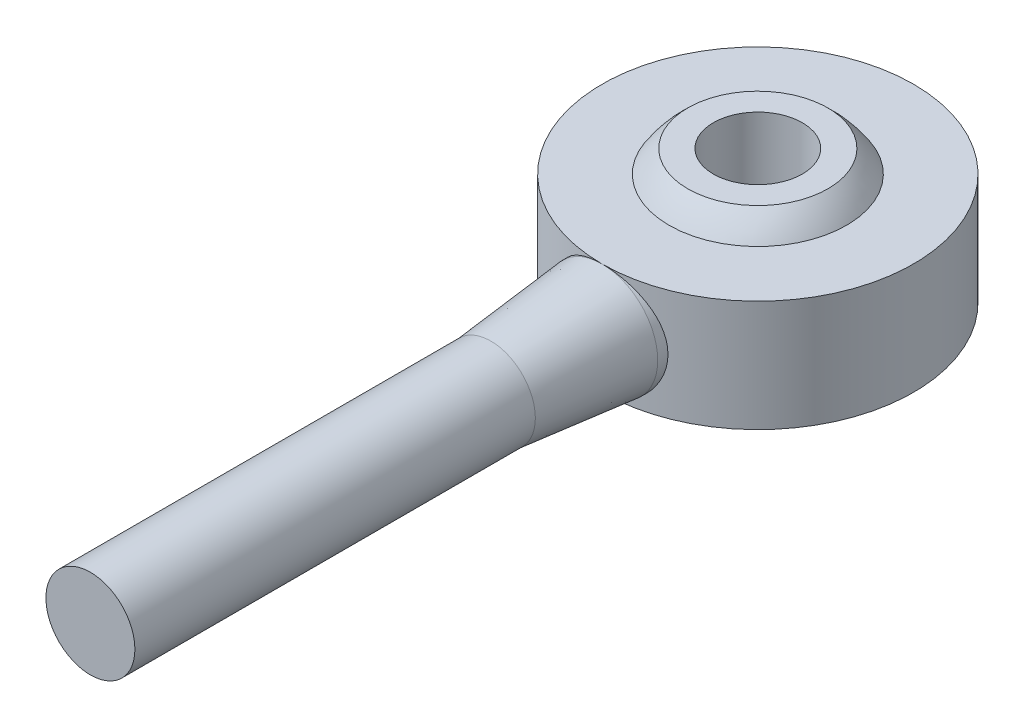
ISO-10303-21;
HEADER;
FILE_DESCRIPTION(('STEP AP214'),'2;1');
FILE_NAME('part.step','',(''),(''),'','','');
FILE_SCHEMA(('AUTOMOTIVE_DESIGN { 1 0 10303 214 1 1 1 1 }'));
ENDSEC;
DATA;
#1=APPLICATION_CONTEXT('core data for automotive mechanical design processes');
#2=APPLICATION_PROTOCOL_DEFINITION('international standard','automotive_design',2000,#1);
#3=PRODUCT_CONTEXT('',#1,'mechanical');
#4=PRODUCT('Part','Part','',(#3));
#5=PRODUCT_RELATED_PRODUCT_CATEGORY('part','',(#4));
#6=PRODUCT_DEFINITION_FORMATION('','',#4);
#7=PRODUCT_DEFINITION_CONTEXT('part definition',#1,'design');
#8=PRODUCT_DEFINITION('design','',#6,#7);
#9=PRODUCT_DEFINITION_SHAPE('','',#8);
#10=(LENGTH_UNIT() NAMED_UNIT(*) SI_UNIT(.MILLI.,.METRE.));
#11=(NAMED_UNIT(*) PLANE_ANGLE_UNIT() SI_UNIT($,.RADIAN.));
#12=(NAMED_UNIT(*) SI_UNIT($,.STERADIAN.) SOLID_ANGLE_UNIT());
#13=UNCERTAINTY_MEASURE_WITH_UNIT(LENGTH_MEASURE(1.E-05),#10,'distance_accuracy_value','');
#14=(GEOMETRIC_REPRESENTATION_CONTEXT(3) GLOBAL_UNCERTAINTY_ASSIGNED_CONTEXT((#13)) GLOBAL_UNIT_ASSIGNED_CONTEXT((#10,
#11,#12)) REPRESENTATION_CONTEXT('',''));
#15=CARTESIAN_POINT('',(0.,0.,0.));
#16=DIRECTION('',(0.,0.,1.));
#17=DIRECTION('',(1.,0.,0.));
#18=AXIS2_PLACEMENT_3D('',#15,#16,#17);
#19=CARTESIAN_POINT('',(0.,2.5,0.));
#20=DIRECTION('',(0.,-1.,0.));
#21=DIRECTION('',(0.,0.,-1.));
#22=AXIS2_PLACEMENT_3D('',#19,#20,#21);
#23=CYLINDRICAL_SURFACE('',#22,7.);
#24=CARTESIAN_POINT('',(0.,2.5,7.));
#25=CARTESIAN_POINT('',(-0.135839760518735,2.50000282404186,7.0000020295295));
#26=CARTESIAN_POINT('',(-0.271659429947531,2.48889324276718,6.99601056603649));
#27=CARTESIAN_POINT('',(-0.539264896606897,2.44490871280793,6.98048404948616));
#28=CARTESIAN_POINT('',(-0.671050847614628,2.41203459493519,6.96894928437749));
#29=CARTESIAN_POINT('',(-0.926692116674317,2.32581485873255,6.93958109810981));
#30=CARTESIAN_POINT('',(-1.05056137145919,2.27250644028005,6.92175912724346));
#31=CARTESIAN_POINT('',(-1.28759585298401,2.14711128063239,6.88161078032354));
#32=CARTESIAN_POINT('',(-1.40075850640075,2.07502004055099,6.85928332539979));
#33=CARTESIAN_POINT('',(-1.61758802805347,1.9111568678836,6.81147377429754));
#34=CARTESIAN_POINT('',(-1.72078015672851,1.81878126899463,6.78590827445072));
#35=CARTESIAN_POINT('',(-1.9105819932243,1.61825363621021,6.73493522536265));
#36=CARTESIAN_POINT('',(-1.99718728701346,1.51009741628361,6.70952771990193));
#37=CARTESIAN_POINT('',(-2.15423735561842,1.27660220722431,6.6608007016897));
#38=CARTESIAN_POINT('',(-2.2240352979483,1.15080525648352,6.63758107761794));
#39=CARTESIAN_POINT('',(-2.34127572230003,0.888296335295655,6.59714352451506));
#40=CARTESIAN_POINT('',(-2.38872619231546,0.751588285432287,6.57992345154766));
#41=CARTESIAN_POINT('',(-2.45809130448528,0.476577163797531,6.55432038222057));
#42=CARTESIAN_POINT('',(-2.48090519407331,0.33853069305689,6.54562733379002));
#43=CARTESIAN_POINT('',(-2.5031615222748,0.0603163681762025,6.53715061879805));
#44=CARTESIAN_POINT('',(-2.50261249605974,-0.0798506925415497,6.53736369856128));
#45=CARTESIAN_POINT('',(-2.4788507897233,-0.350355655052487,6.54640588297195));
#46=CARTESIAN_POINT('',(-2.45685161763648,-0.480818352999741,6.55477363669039));
#47=CARTESIAN_POINT('',(-2.3928085105506,-0.736061527183343,6.57842082174382));
#48=CARTESIAN_POINT('',(-2.35076183734614,-0.860841224650792,6.59370119723067));
#49=CARTESIAN_POINT('',(-2.247095668441,-1.10377374578572,6.62975170487814));
#50=CARTESIAN_POINT('',(-2.18514195933256,-1.22176960265853,6.65061447775042));
#51=CARTESIAN_POINT('',(-2.04365272690694,-1.44605638664971,6.69544469696369));
#52=CARTESIAN_POINT('',(-1.96411154980233,-1.55234353330741,6.71941314064672));
#53=CARTESIAN_POINT('',(-1.78403149047107,-1.75695959137113,6.76952498465894));
#54=CARTESIAN_POINT('',(-1.68251331515438,-1.85441785924916,6.7957122347435));
#55=CARTESIAN_POINT('',(-1.46426184534914,-2.03117168283478,6.84605473605515));
#56=CARTESIAN_POINT('',(-1.3475266301937,-2.11046494229876,6.87020973014028));
#57=CARTESIAN_POINT('',(-1.10010034292175,-2.2494806099392,6.91416998722002));
#58=CARTESIAN_POINT('',(-0.96924911242521,-2.30893823988978,6.93391532170414));
#59=CARTESIAN_POINT('',(-0.698523468127248,-2.40471582416036,6.96639167687355));
#60=CARTESIAN_POINT('',(-0.558652699053766,-2.44104506076263,6.97912551125634));
#61=CARTESIAN_POINT('',(-0.281205091813833,-2.48791915065958,6.99566202632136));
#62=CARTESIAN_POINT('',(-0.143850613169092,-2.49963813074565,6.99987103999093));
#63=CARTESIAN_POINT('',(0.130909371573394,-2.50034512199022,7.00012297890716));
#64=CARTESIAN_POINT('',(0.268314862212672,-2.48933762699178,6.99616751856457));
#65=CARTESIAN_POINT('',(0.53436869899777,-2.44581386267842,6.98080349995239));
#66=CARTESIAN_POINT('',(0.663155848081401,-2.41404524420185,6.96965417819419));
#67=CARTESIAN_POINT('',(0.913499444029995,-2.33086340526394,6.94128245796678));
#68=CARTESIAN_POINT('',(1.03505494970017,-2.27944763417143,6.9240592709991));
#69=CARTESIAN_POINT('',(1.27131790851501,-2.15684114659839,6.88465739573328));
#70=CARTESIAN_POINT('',(1.38573546298722,-2.08513351950063,6.86235262462323));
#71=CARTESIAN_POINT('',(1.60127936897371,-1.92457250489255,6.81528395513799));
#72=CARTESIAN_POINT('',(1.70240114063959,-1.83571323522616,6.79051921453452));
#73=CARTESIAN_POINT('',(1.89402292059753,-1.63787036727108,6.73966040960453));
#74=CARTESIAN_POINT('',(1.98368681906969,-1.52807528698033,6.71356479866296));
#75=CARTESIAN_POINT('',(2.14345525781599,-1.29445872999565,6.6642787599771));
#76=CARTESIAN_POINT('',(2.21355884309556,-1.17063656887139,6.64108847411013));
#77=CARTESIAN_POINT('',(2.33208686094212,-0.911935190763942,6.60040332956606));
#78=CARTESIAN_POINT('',(2.3804881075604,-0.777044329490132,6.58291456759544));
#79=CARTESIAN_POINT('',(2.45361419016748,-0.500239899279892,6.55601442004241));
#80=CARTESIAN_POINT('',(2.4783518546378,-0.358330179337675,6.54659865821928));
#81=CARTESIAN_POINT('',(2.50236255506862,-0.0804795206269917,6.53745596427834));
#82=CARTESIAN_POINT('',(2.50304426978182,0.0553232144244185,6.53719306756498));
#83=CARTESIAN_POINT('',(2.48247035008869,0.324997670654891,6.54503319463772));
#84=CARTESIAN_POINT('',(2.46121642244208,0.458869541248156,6.55313556754228));
#85=CARTESIAN_POINT('',(2.39843007607193,0.717500585371859,6.57636700427785));
#86=CARTESIAN_POINT('',(2.35741961008936,0.842404099005789,6.59131474248996));
#87=CARTESIAN_POINT('',(2.25672644338171,1.08364268186691,6.62646329315119));
#88=CARTESIAN_POINT('',(2.19703924956895,1.1999756809442,6.64666536944648));
#89=CARTESIAN_POINT('',(2.05730313071904,1.42692574995226,6.69127230994833));
#90=CARTESIAN_POINT('',(1.97640371595173,1.53698804086291,6.71583400336863));
#91=CARTESIAN_POINT('',(1.79790863011924,1.74242750466051,6.76580411328317));
#92=CARTESIAN_POINT('',(1.70030791033581,1.83780022035101,6.79121278393859));
#93=CARTESIAN_POINT('',(1.48566252339524,2.01572190281657,6.84145445667706));
#94=CARTESIAN_POINT('',(1.36791750616705,2.09745303979088,6.86620367070764));
#95=CARTESIAN_POINT('',(1.11951131249464,2.23990766383788,6.91104924401846));
#96=CARTESIAN_POINT('',(0.988851114158936,2.3006327402027,6.93114595526313));
#97=CARTESIAN_POINT('',(0.717646336524983,2.39914031030858,6.96446006180832));
#98=CARTESIAN_POINT('',(0.577062560467784,2.43682540816267,6.97764821973896));
#99=CARTESIAN_POINT('',(0.290976881134821,2.48724887463881,6.99541542277591));
#100=CARTESIAN_POINT('',(0.145476919097826,2.49999697560635,6.99999782648543));
#101=CARTESIAN_POINT('',(0.,2.5,7.));
#102=B_SPLINE_CURVE_WITH_KNOTS('',3,(#24,#25,#26,#27,#28,#29,#30,#31,#32,#33,#34,#35,#36,#37,
#38,#39,#40,#41,#42,#43,#44,#45,#46,#47,#48,#49,#50,#51,#52,#53,#54,#55,#56,#57,#58,#59,#60,#61,
#62,#63,#64,#65,#66,#67,#68,#69,#70,#71,#72,#73,#74,#75,#76,#77,#78,#79,#80,#81,#82,#83,#84,#85,
#86,#87,#88,#89,#90,#91,#92,#93,#94,#95,#96,#97,#98,#99,#100,#101),.UNSPECIFIED.,.T.,.F.,(4,2,2,
2,2,2,2,2,2,2,2,2,2,2,2,2,2,2,2,2,2,2,2,2,2,2,2,2,2,2,2,2,2,2,2,2,2,2,4),(0.,0.406983217142954,
0.813950899519932,1.22018120425629,1.62650889940498,2.04714572459521,2.46789433314937,
2.90289606780334,3.3377421950035,3.75611562378725,4.17433620956451,4.57019246497947,
4.96610280426156,5.36904149669469,5.77210990935867,6.19956653135137,6.62707715847137,
7.06008524763626,7.49291944485573,7.90458529912081,8.31616976000826,8.71369326802826,
9.11126840085792,9.52005856953123,9.92898918269314,10.3593838463852,10.7897995195909,
11.2206739431307,11.6513146487842,12.0566930957309,12.4620400035307,12.8572208236401,
13.2524967861626,13.6670344525245,14.0816976535747,14.5159343578492,14.9501382011315,
15.3861650682914,15.8220217300551),.UNSPECIFIED.);
#103=CARTESIAN_POINT('',(0.,2.5,7.));
#104=VERTEX_POINT('',#103);
#105=CARTESIAN_POINT('',(0.,-2.5,7.));
#106=VERTEX_POINT('',#105);
#107=EDGE_CURVE('E11',#104,#106,#102,.T.);
#108=ORIENTED_EDGE('',*,*,#107,.F.);
#109=CARTESIAN_POINT('',(0.,2.5,0.));
#110=DIRECTION('',(0.,1.,0.));
#111=DIRECTION('',(0.,0.,1.));
#112=AXIS2_PLACEMENT_3D('',#109,#110,#111);
#113=CIRCLE('',#112,7.);
#114=EDGE_CURVE('E57',#104,#104,#113,.T.);
#115=ORIENTED_EDGE('',*,*,#114,.F.);
#116=EDGE_CURVE('E40',#106,#104,#102,.T.);
#117=ORIENTED_EDGE('',*,*,#116,.F.);
#118=CARTESIAN_POINT('',(0.,-2.5,0.));
#119=DIRECTION('',(0.,1.,0.));
#120=DIRECTION('',(0.,0.,1.));
#121=AXIS2_PLACEMENT_3D('',#118,#119,#120);
#122=CIRCLE('',#121,7.);
#123=EDGE_CURVE('E60',#106,#106,#122,.T.);
#124=ORIENTED_EDGE('',*,*,#123,.T.);
#125=EDGE_LOOP('',(#108,#115,#117,#124));
#126=FACE_BOUND('',#125,.T.);
#127=ADVANCED_FACE('F36',(#126),#23,.T.);
#128=CARTESIAN_POINT('',(0.,0.,0.));
#129=DIRECTION('',(0.,1.,0.));
#130=DIRECTION('',(0.,0.,1.));
#131=AXIS2_PLACEMENT_3D('',#128,#129,#130);
#132=SPHERICAL_SURFACE('',#131,4.7087684164758);
#133=CARTESIAN_POINT('',(0.,-3.5,0.));
#134=DIRECTION('',(0.,1.,0.));
#135=DIRECTION('',(0.,0.,1.));
#136=AXIS2_PLACEMENT_3D('',#133,#134,#135);
#137=CIRCLE('',#136,3.15);
#138=CARTESIAN_POINT('',(0.,-3.5,3.15));
#139=VERTEX_POINT('',#138);
#140=EDGE_CURVE('E70',#139,#139,#137,.T.);
#141=ORIENTED_EDGE('',*,*,#140,.T.);
#142=EDGE_LOOP('',(#141));
#143=FACE_BOUND('',#142,.T.);
#144=CARTESIAN_POINT('',(0.,-2.5,0.));
#145=DIRECTION('',(0.,1.,0.));
#146=DIRECTION('',(0.,0.,1.));
#147=AXIS2_PLACEMENT_3D('',#144,#145,#146);
#148=CIRCLE('',#147,3.99030074054576);
#149=CARTESIAN_POINT('',(0.,-2.5,3.99030074054576));
#150=VERTEX_POINT('',#149);
#151=EDGE_CURVE('E66',#150,#150,#148,.T.);
#152=ORIENTED_EDGE('',*,*,#151,.F.);
#153=EDGE_LOOP('',(#152));
#154=FACE_BOUND('',#153,.T.);
#155=ADVANCED_FACE('F121',(#143,#154),#132,.T.);
#156=CARTESIAN_POINT('',(0.,2.5,0.));
#157=DIRECTION('',(0.,1.,0.));
#158=DIRECTION('',(0.,0.,1.));
#159=AXIS2_PLACEMENT_3D('',#156,#157,#158);
#160=CIRCLE('',#159,3.99030074054576);
#161=CARTESIAN_POINT('',(0.,2.5,3.99030074054576));
#162=VERTEX_POINT('',#161);
#163=EDGE_CURVE('E59',#162,#162,#160,.T.);
#164=ORIENTED_EDGE('',*,*,#163,.T.);
#165=EDGE_LOOP('',(#164));
#166=FACE_BOUND('',#165,.T.);
#167=CARTESIAN_POINT('',(0.,3.5,0.));
#168=DIRECTION('',(0.,1.,0.));
#169=DIRECTION('',(0.,0.,1.));
#170=AXIS2_PLACEMENT_3D('',#167,#168,#169);
#171=CIRCLE('',#170,3.15);
#172=CARTESIAN_POINT('',(0.,3.5,3.15));
#173=VERTEX_POINT('',#172);
#174=EDGE_CURVE('E83',#173,#173,#171,.T.);
#175=ORIENTED_EDGE('',*,*,#174,.F.);
#176=EDGE_LOOP('',(#175));
#177=FACE_BOUND('',#176,.T.);
#178=ADVANCED_FACE('F125',(#166,#177),#132,.T.);
#179=CARTESIAN_POINT('',(0.,-3.5,2.));
#180=DIRECTION('',(0.,-1.,0.));
#181=DIRECTION('',(0.,0.,-1.));
#182=AXIS2_PLACEMENT_3D('',#179,#180,#181);
#183=PLANE('',#182);
#184=CARTESIAN_POINT('',(0.,-3.5,0.));
#185=DIRECTION('',(0.,1.,0.));
#186=DIRECTION('',(0.,0.,1.));
#187=AXIS2_PLACEMENT_3D('',#184,#185,#186);
#188=CIRCLE('',#187,2.);
#189=CARTESIAN_POINT('',(0.,-3.5,2.));
#190=VERTEX_POINT('',#189);
#191=EDGE_CURVE('E74',#190,#190,#188,.T.);
#192=ORIENTED_EDGE('',*,*,#191,.T.);
#193=EDGE_LOOP('',(#192));
#194=FACE_BOUND('',#193,.T.);
#195=ORIENTED_EDGE('',*,*,#140,.F.);
#196=EDGE_LOOP('',(#195));
#197=FACE_BOUND('',#196,.T.);
#198=ADVANCED_FACE('F130',(#194,#197),#183,.T.);
#199=CARTESIAN_POINT('',(0.,6.,0.));
#200=DIRECTION('',(0.,1.,0.));
#201=DIRECTION('',(0.,0.,1.));
#202=AXIS2_PLACEMENT_3D('',#199,#200,#201);
#203=CYLINDRICAL_SURFACE('',#202,2.);
#204=CARTESIAN_POINT('',(0.,3.5,0.));
#205=DIRECTION('',(0.,1.,0.));
#206=DIRECTION('',(0.,0.,1.));
#207=AXIS2_PLACEMENT_3D('',#204,#205,#206);
#208=CIRCLE('',#207,2.);
#209=CARTESIAN_POINT('',(0.,3.5,2.));
#210=VERTEX_POINT('',#209);
#211=EDGE_CURVE('E78',#210,#210,#208,.T.);
#212=ORIENTED_EDGE('',*,*,#211,.T.);
#213=EDGE_LOOP('',(#212));
#214=FACE_BOUND('',#213,.T.);
#215=ORIENTED_EDGE('',*,*,#191,.F.);
#216=EDGE_LOOP('',(#215));
#217=FACE_BOUND('',#216,.T.);
#218=ADVANCED_FACE('F142',(#214,#217),#203,.F.);
#219=CARTESIAN_POINT('',(0.,3.5,3.15));
#220=DIRECTION('',(0.,1.,0.));
#221=DIRECTION('',(0.,0.,1.));
#222=AXIS2_PLACEMENT_3D('',#219,#220,#221);
#223=PLANE('',#222);
#224=ORIENTED_EDGE('',*,*,#174,.T.);
#225=EDGE_LOOP('',(#224));
#226=FACE_BOUND('',#225,.T.);
#227=ORIENTED_EDGE('',*,*,#211,.F.);
#228=EDGE_LOOP('',(#227));
#229=FACE_BOUND('',#228,.T.);
#230=ADVANCED_FACE('F137',(#226,#229),#223,.T.);
#231=CARTESIAN_POINT('',(0.,2.5,0.));
#232=DIRECTION('',(0.,1.,0.));
#233=DIRECTION('',(0.,0.,1.));
#234=AXIS2_PLACEMENT_3D('',#231,#232,#233);
#235=PLANE('',#234);
#236=ORIENTED_EDGE('',*,*,#163,.F.);
#237=EDGE_LOOP('',(#236));
#238=FACE_BOUND('',#237,.T.);
#239=ORIENTED_EDGE('',*,*,#114,.T.);
#240=EDGE_LOOP('',(#239));
#241=FACE_BOUND('',#240,.T.);
#242=ADVANCED_FACE('F117',(#238,#241),#235,.T.);
#243=CARTESIAN_POINT('',(0.,-2.5,0.));
#244=DIRECTION('',(0.,1.,0.));
#245=DIRECTION('',(0.,0.,1.));
#246=AXIS2_PLACEMENT_3D('',#243,#244,#245);
#247=PLANE('',#246);
#248=ORIENTED_EDGE('',*,*,#151,.T.);
#249=EDGE_LOOP('',(#248));
#250=FACE_BOUND('',#249,.T.);
#251=ORIENTED_EDGE('',*,*,#123,.F.);
#252=EDGE_LOOP('',(#251));
#253=FACE_BOUND('',#252,.T.);
#254=ADVANCED_FACE('F111',(#250,#253),#247,.F.);
#255=CARTESIAN_POINT('',(0.,0.,30.));
#256=DIRECTION('',(0.,0.,1.));
#257=DIRECTION('',(1.,0.,0.));
#258=AXIS2_PLACEMENT_3D('',#255,#256,#257);
#259=CYLINDRICAL_SURFACE('',#258,2.5);
#260=CARTESIAN_POINT('',(0.,0.,7.));
#261=DIRECTION('',(0.,0.,1.));
#262=DIRECTION('',(1.,0.,0.));
#263=AXIS2_PLACEMENT_3D('',#260,#261,#262);
#264=CIRCLE('',#263,2.5);
#265=EDGE_CURVE('E95',#104,#106,#264,.T.);
#266=ORIENTED_EDGE('',*,*,#265,.F.);
#267=ORIENTED_EDGE('',*,*,#107,.T.);
#268=EDGE_LOOP('',(#266,#267));
#269=FACE_BOUND('',#268,.T.);
#270=ADVANCED_FACE('F108',(#269),#259,.T.);
#271=EDGE_CURVE('E98',#106,#104,#264,.T.);
#272=ORIENTED_EDGE('',*,*,#271,.F.);
#273=ORIENTED_EDGE('',*,*,#116,.T.);
#274=EDGE_LOOP('',(#272,#273));
#275=FACE_BOUND('',#274,.T.);
#276=ADVANCED_FACE('F110',(#275),#259,.T.);
#277=CARTESIAN_POINT('',(0.,0.,30.));
#278=DIRECTION('',(0.,0.,-1.));
#279=DIRECTION('',(-1.,0.,0.));
#280=AXIS2_PLACEMENT_3D('',#277,#278,#279);
#281=PLANE('',#280);
#282=CARTESIAN_POINT('',(0.,0.,30.));
#283=DIRECTION('',(0.,0.,1.));
#284=DIRECTION('',(1.,0.,0.));
#285=AXIS2_PLACEMENT_3D('',#282,#283,#284);
#286=CIRCLE('',#285,2.);
#287=CARTESIAN_POINT('',(2.,0.,30.));
#288=VERTEX_POINT('',#287);
#289=EDGE_CURVE('E87',#288,#288,#286,.T.);
#290=ORIENTED_EDGE('',*,*,#289,.T.);
#291=EDGE_LOOP('',(#290));
#292=FACE_BOUND('',#291,.T.);
#293=ADVANCED_FACE('F116',(#292),#281,.F.);
#294=CARTESIAN_POINT('',(0.,0.,30.));
#295=DIRECTION('',(0.,0.,1.));
#296=DIRECTION('',(1.,0.,0.));
#297=AXIS2_PLACEMENT_3D('',#294,#295,#296);
#298=CYLINDRICAL_SURFACE('',#297,2.);
#299=ORIENTED_EDGE('',*,*,#289,.F.);
#300=EDGE_LOOP('',(#299));
#301=FACE_BOUND('',#300,.T.);
#302=CARTESIAN_POINT('',(0.,0.,12.));
#303=DIRECTION('',(0.,0.,1.));
#304=DIRECTION('',(1.,0.,0.));
#305=AXIS2_PLACEMENT_3D('',#302,#303,#304);
#306=CIRCLE('',#305,2.);
#307=CARTESIAN_POINT('',(2.,0.,12.));
#308=VERTEX_POINT('',#307);
#309=EDGE_CURVE('E91',#308,#308,#306,.T.);
#310=ORIENTED_EDGE('',*,*,#309,.T.);
#311=EDGE_LOOP('',(#310));
#312=FACE_BOUND('',#311,.T.);
#313=ADVANCED_FACE('F215',(#301,#312),#298,.T.);
#314=CARTESIAN_POINT('',(0.,0.,7.));
#315=DIRECTION('',(0.,0.,-1.));
#316=DIRECTION('',(-1.,0.,0.));
#317=AXIS2_PLACEMENT_3D('',#314,#315,#316);
#318=CONICAL_SURFACE('',#317,2.5,0.099668652491162);
#319=ORIENTED_EDGE('',*,*,#309,.F.);
#320=EDGE_LOOP('',(#319));
#321=FACE_BOUND('',#320,.T.);
#322=ORIENTED_EDGE('',*,*,#265,.T.);
#323=ORIENTED_EDGE('',*,*,#271,.T.);
#324=EDGE_LOOP('',(#322,#323));
#325=FACE_BOUND('',#324,.T.);
#326=ADVANCED_FACE('F105',(#321,#325),#318,.T.);
#327=CLOSED_SHELL('',(#127,#155,#178,#198,#218,#230,#242,#254,#270,#276,#293,#313,#326));
#328=MANIFOLD_SOLID_BREP('B2',#327);
#329=ADVANCED_BREP_SHAPE_REPRESENTATION('',(#18,#328),#14);
#330=SHAPE_DEFINITION_REPRESENTATION(#9,#329);
ENDSEC;
END-ISO-10303-21;
